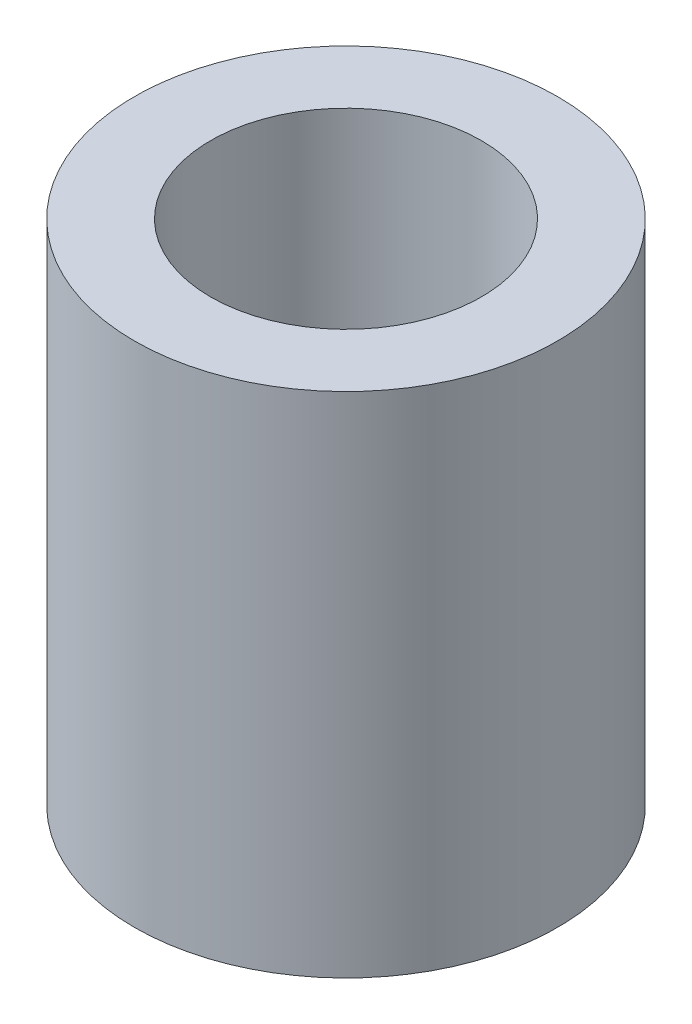
ISO-10303-21;
HEADER;
FILE_DESCRIPTION(('STEP AP214'),'2;1');
FILE_NAME('part.step','',(''),(''),'','','');
FILE_SCHEMA(('AUTOMOTIVE_DESIGN { 1 0 10303 214 1 1 1 1 }'));
ENDSEC;
DATA;
#1=APPLICATION_CONTEXT('core data for automotive mechanical design processes');
#2=APPLICATION_PROTOCOL_DEFINITION('international standard','automotive_design',2000,#1);
#3=PRODUCT_CONTEXT('',#1,'mechanical');
#4=PRODUCT('Part','Part','',(#3));
#5=PRODUCT_RELATED_PRODUCT_CATEGORY('part','',(#4));
#6=PRODUCT_DEFINITION_FORMATION('','',#4);
#7=PRODUCT_DEFINITION_CONTEXT('part definition',#1,'design');
#8=PRODUCT_DEFINITION('design','',#6,#7);
#9=PRODUCT_DEFINITION_SHAPE('','',#8);
#10=(LENGTH_UNIT() NAMED_UNIT(*) SI_UNIT(.MILLI.,.METRE.));
#11=(NAMED_UNIT(*) PLANE_ANGLE_UNIT() SI_UNIT($,.RADIAN.));
#12=(NAMED_UNIT(*) SI_UNIT($,.STERADIAN.) SOLID_ANGLE_UNIT());
#13=UNCERTAINTY_MEASURE_WITH_UNIT(LENGTH_MEASURE(1.E-05),#10,'distance_accuracy_value','');
#14=(GEOMETRIC_REPRESENTATION_CONTEXT(3) GLOBAL_UNCERTAINTY_ASSIGNED_CONTEXT((#13)) GLOBAL_UNIT_ASSIGNED_CONTEXT((#10,
#11,#12)) REPRESENTATION_CONTEXT('',''));
#15=CARTESIAN_POINT('',(0.,0.,0.));
#16=DIRECTION('',(0.,0.,1.));
#17=DIRECTION('',(1.,0.,0.));
#18=AXIS2_PLACEMENT_3D('',#15,#16,#17);
#19=CARTESIAN_POINT('',(0.,6.00000000000001,0.));
#20=DIRECTION('',(0.,1.,0.));
#21=DIRECTION('',(0.,0.,1.));
#22=AXIS2_PLACEMENT_3D('',#19,#20,#21);
#23=PLANE('',#22);
#24=CARTESIAN_POINT('',(0.,6.00000000000001,0.));
#25=DIRECTION('',(0.,1.,0.));
#26=DIRECTION('',(0.,0.,1.));
#27=AXIS2_PLACEMENT_3D('',#24,#25,#26);
#28=CIRCLE('',#27,2.5);
#29=CARTESIAN_POINT('',(0.,6.00000000000001,2.5));
#30=VERTEX_POINT('',#29);
#31=EDGE_CURVE('E10',#30,#30,#28,.T.);
#32=ORIENTED_EDGE('',*,*,#31,.T.);
#33=EDGE_LOOP('',(#32));
#34=FACE_BOUND('',#33,.T.);
#35=CARTESIAN_POINT('',(0.,6.00000000000001,0.));
#36=DIRECTION('',(0.,1.,0.));
#37=DIRECTION('',(0.,0.,1.));
#38=AXIS2_PLACEMENT_3D('',#35,#36,#37);
#39=CIRCLE('',#38,1.6);
#40=CARTESIAN_POINT('',(0.,6.00000000000001,1.6));
#41=VERTEX_POINT('',#40);
#42=EDGE_CURVE('E41',#41,#41,#39,.T.);
#43=ORIENTED_EDGE('',*,*,#42,.F.);
#44=EDGE_LOOP('',(#43));
#45=FACE_BOUND('',#44,.T.);
#46=ADVANCED_FACE('F30',(#34,#45),#23,.T.);
#47=CARTESIAN_POINT('',(0.,0.,0.));
#48=DIRECTION('',(0.,1.,0.));
#49=DIRECTION('',(0.,0.,1.));
#50=AXIS2_PLACEMENT_3D('',#47,#48,#49);
#51=PLANE('',#50);
#52=CARTESIAN_POINT('',(0.,0.,0.));
#53=DIRECTION('',(0.,1.,0.));
#54=DIRECTION('',(0.,0.,1.));
#55=AXIS2_PLACEMENT_3D('',#52,#53,#54);
#56=CIRCLE('',#55,2.5);
#57=CARTESIAN_POINT('',(0.,0.,2.5));
#58=VERTEX_POINT('',#57);
#59=EDGE_CURVE('E34',#58,#58,#56,.T.);
#60=ORIENTED_EDGE('',*,*,#59,.F.);
#61=EDGE_LOOP('',(#60));
#62=FACE_BOUND('',#61,.T.);
#63=CARTESIAN_POINT('',(0.,0.,0.));
#64=DIRECTION('',(0.,1.,0.));
#65=DIRECTION('',(0.,0.,1.));
#66=AXIS2_PLACEMENT_3D('',#63,#64,#65);
#67=CIRCLE('',#66,1.6);
#68=CARTESIAN_POINT('',(0.,0.,1.6));
#69=VERTEX_POINT('',#68);
#70=EDGE_CURVE('E43',#69,#69,#67,.T.);
#71=ORIENTED_EDGE('',*,*,#70,.T.);
#72=EDGE_LOOP('',(#71));
#73=FACE_BOUND('',#72,.T.);
#74=ADVANCED_FACE('F53',(#62,#73),#51,.F.);
#75=CARTESIAN_POINT('',(0.,6.00000000000001,0.));
#76=DIRECTION('',(0.,-1.,0.));
#77=DIRECTION('',(0.,0.,-1.));
#78=AXIS2_PLACEMENT_3D('',#75,#76,#77);
#79=CYLINDRICAL_SURFACE('',#78,2.5);
#80=ORIENTED_EDGE('',*,*,#31,.F.);
#81=EDGE_LOOP('',(#80));
#82=FACE_BOUND('',#81,.T.);
#83=ORIENTED_EDGE('',*,*,#59,.T.);
#84=EDGE_LOOP('',(#83));
#85=FACE_BOUND('',#84,.T.);
#86=ADVANCED_FACE('F32',(#82,#85),#79,.T.);
#87=CARTESIAN_POINT('',(0.,6.00000000000001,0.));
#88=DIRECTION('',(0.,-1.,0.));
#89=DIRECTION('',(0.,0.,-1.));
#90=AXIS2_PLACEMENT_3D('',#87,#88,#89);
#91=CYLINDRICAL_SURFACE('',#90,1.6);
#92=ORIENTED_EDGE('',*,*,#42,.T.);
#93=EDGE_LOOP('',(#92));
#94=FACE_BOUND('',#93,.T.);
#95=ORIENTED_EDGE('',*,*,#70,.F.);
#96=EDGE_LOOP('',(#95));
#97=FACE_BOUND('',#96,.T.);
#98=ADVANCED_FACE('F49',(#94,#97),#91,.F.);
#99=CLOSED_SHELL('',(#46,#74,#86,#98));
#100=MANIFOLD_SOLID_BREP('B2',#99);
#101=ADVANCED_BREP_SHAPE_REPRESENTATION('',(#18,#100),#14);
#102=SHAPE_DEFINITION_REPRESENTATION(#9,#101);
ENDSEC;
END-ISO-10303-21;
